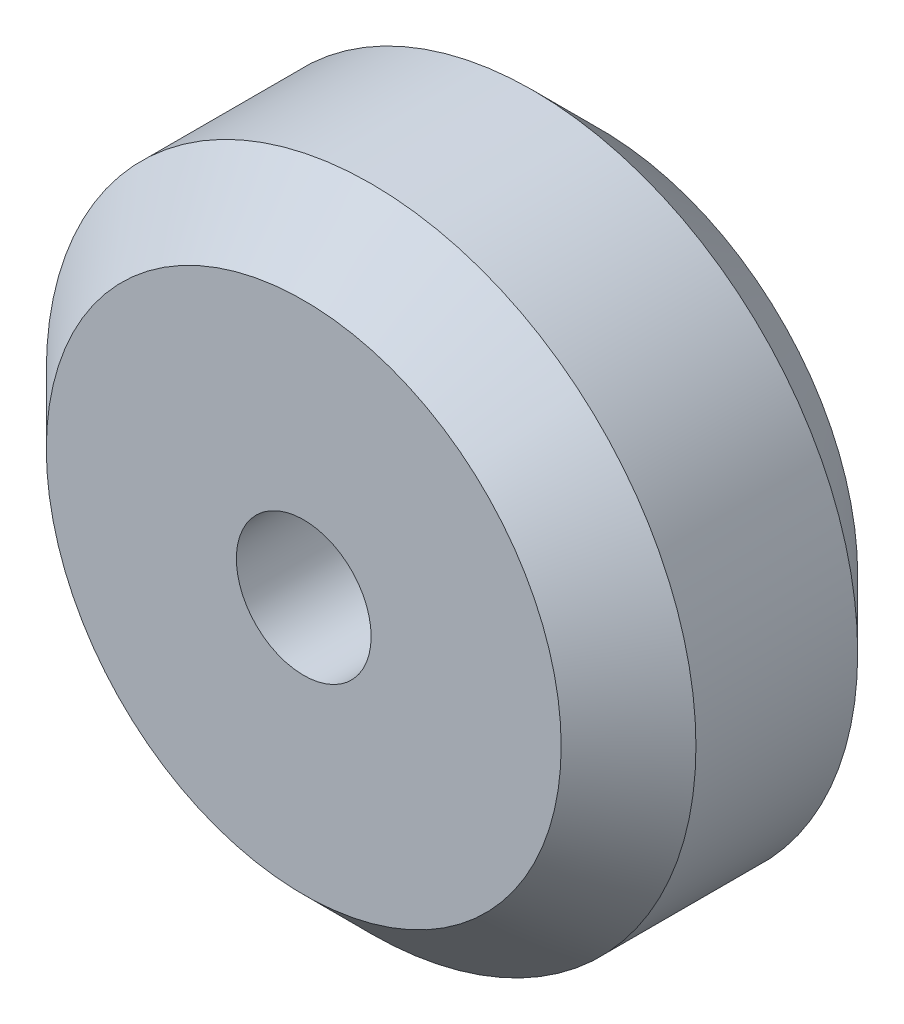
ISO-10303-21;
HEADER;
FILE_DESCRIPTION(('STEP AP214'),'2;1');
FILE_NAME('part.step','',(''),(''),'','','');
FILE_SCHEMA(('AUTOMOTIVE_DESIGN { 1 0 10303 214 1 1 1 1 }'));
ENDSEC;
DATA;
#1=APPLICATION_CONTEXT('core data for automotive mechanical design processes');
#2=APPLICATION_PROTOCOL_DEFINITION('international standard','automotive_design',2000,#1);
#3=PRODUCT_CONTEXT('',#1,'mechanical');
#4=PRODUCT('Part','Part','',(#3));
#5=PRODUCT_RELATED_PRODUCT_CATEGORY('part','',(#4));
#6=PRODUCT_DEFINITION_FORMATION('','',#4);
#7=PRODUCT_DEFINITION_CONTEXT('part definition',#1,'design');
#8=PRODUCT_DEFINITION('design','',#6,#7);
#9=PRODUCT_DEFINITION_SHAPE('','',#8);
#10=(LENGTH_UNIT() NAMED_UNIT(*) SI_UNIT(.MILLI.,.METRE.));
#11=(NAMED_UNIT(*) PLANE_ANGLE_UNIT() SI_UNIT($,.RADIAN.));
#12=(NAMED_UNIT(*) SI_UNIT($,.STERADIAN.) SOLID_ANGLE_UNIT());
#13=UNCERTAINTY_MEASURE_WITH_UNIT(LENGTH_MEASURE(1.E-05),#10,'distance_accuracy_value','');
#14=(GEOMETRIC_REPRESENTATION_CONTEXT(3) GLOBAL_UNCERTAINTY_ASSIGNED_CONTEXT((#13)) GLOBAL_UNIT_ASSIGNED_CONTEXT((#10,
#11,#12)) REPRESENTATION_CONTEXT('',''));
#15=CARTESIAN_POINT('',(0.,0.,0.));
#16=DIRECTION('',(0.,0.,1.));
#17=DIRECTION('',(1.,0.,0.));
#18=AXIS2_PLACEMENT_3D('',#15,#16,#17);
#19=CARTESIAN_POINT('',(0.,0.,11.));
#20=DIRECTION('',(0.,0.,1.));
#21=DIRECTION('',(1.,0.,0.));
#22=AXIS2_PLACEMENT_3D('',#19,#20,#21);
#23=PLANE('',#22);
#24=CARTESIAN_POINT('',(0.,0.,11.));
#25=DIRECTION('',(0.,0.,1.));
#26=DIRECTION('',(1.,0.,0.));
#27=AXIS2_PLACEMENT_3D('',#24,#25,#26);
#28=CIRCLE('',#27,9.55);
#29=CARTESIAN_POINT('',(9.55,0.,11.));
#30=VERTEX_POINT('',#29);
#31=EDGE_CURVE('E10',#30,#30,#28,.T.);
#32=ORIENTED_EDGE('',*,*,#31,.T.);
#33=EDGE_LOOP('',(#32));
#34=FACE_BOUND('',#33,.T.);
#35=CARTESIAN_POINT('',(0.,0.,11.));
#36=DIRECTION('',(0.,0.,1.));
#37=DIRECTION('',(1.,0.,0.));
#38=AXIS2_PLACEMENT_3D('',#35,#36,#37);
#39=CIRCLE('',#38,2.5);
#40=CARTESIAN_POINT('',(2.5,0.,11.));
#41=VERTEX_POINT('',#40);
#42=EDGE_CURVE('E54',#41,#41,#39,.T.);
#43=ORIENTED_EDGE('',*,*,#42,.F.);
#44=EDGE_LOOP('',(#43));
#45=FACE_BOUND('',#44,.T.);
#46=ADVANCED_FACE('F33',(#34,#45),#23,.T.);
#47=CARTESIAN_POINT('',(0.,0.,0.));
#48=DIRECTION('',(0.,0.,1.));
#49=DIRECTION('',(1.,0.,0.));
#50=AXIS2_PLACEMENT_3D('',#47,#48,#49);
#51=PLANE('',#50);
#52=CARTESIAN_POINT('',(0.,0.,0.));
#53=DIRECTION('',(0.,0.,1.));
#54=DIRECTION('',(1.,0.,0.));
#55=AXIS2_PLACEMENT_3D('',#52,#53,#54);
#56=CIRCLE('',#55,9.54999999999998);
#57=CARTESIAN_POINT('',(9.54999999999998,0.,0.));
#58=VERTEX_POINT('',#57);
#59=EDGE_CURVE('E41',#58,#58,#56,.F.);
#60=ORIENTED_EDGE('',*,*,#59,.T.);
#61=EDGE_LOOP('',(#60));
#62=FACE_BOUND('',#61,.T.);
#63=CARTESIAN_POINT('',(0.,0.,0.));
#64=DIRECTION('',(0.,0.,1.));
#65=DIRECTION('',(1.,0.,0.));
#66=AXIS2_PLACEMENT_3D('',#63,#64,#65);
#67=CIRCLE('',#66,2.5);
#68=CARTESIAN_POINT('',(2.5,0.,0.));
#69=VERTEX_POINT('',#68);
#70=EDGE_CURVE('E55',#69,#69,#67,.T.);
#71=ORIENTED_EDGE('',*,*,#70,.T.);
#72=EDGE_LOOP('',(#71));
#73=FACE_BOUND('',#72,.T.);
#74=ADVANCED_FACE('F65',(#62,#73),#51,.F.);
#75=CARTESIAN_POINT('',(0.,0.,11.));
#76=DIRECTION('',(0.,0.,-1.));
#77=DIRECTION('',(-1.,0.,0.));
#78=AXIS2_PLACEMENT_3D('',#75,#76,#77);
#79=CYLINDRICAL_SURFACE('',#78,12.05);
#80=CARTESIAN_POINT('',(0.,0.,2.50000000000001));
#81=DIRECTION('',(0.,0.,1.));
#82=DIRECTION('',(1.,0.,0.));
#83=AXIS2_PLACEMENT_3D('',#80,#81,#82);
#84=CIRCLE('',#83,12.05);
#85=CARTESIAN_POINT('',(12.05,0.,2.50000000000001));
#86=VERTEX_POINT('',#85);
#87=EDGE_CURVE('E45',#86,#86,#84,.T.);
#88=ORIENTED_EDGE('',*,*,#87,.T.);
#89=EDGE_LOOP('',(#88));
#90=FACE_BOUND('',#89,.T.);
#91=CARTESIAN_POINT('',(0.,0.,8.49999999999999));
#92=DIRECTION('',(0.,0.,1.));
#93=DIRECTION('',(1.,0.,0.));
#94=AXIS2_PLACEMENT_3D('',#91,#92,#93);
#95=CIRCLE('',#94,12.05);
#96=CARTESIAN_POINT('',(12.05,0.,8.49999999999999));
#97=VERTEX_POINT('',#96);
#98=EDGE_CURVE('E49',#97,#97,#95,.F.);
#99=ORIENTED_EDGE('',*,*,#98,.T.);
#100=EDGE_LOOP('',(#99));
#101=FACE_BOUND('',#100,.T.);
#102=ADVANCED_FACE('F71',(#90,#101),#79,.T.);
#103=CARTESIAN_POINT('',(0.,0.,11.));
#104=DIRECTION('',(0.,0.,-1.));
#105=DIRECTION('',(-1.,0.,0.));
#106=AXIS2_PLACEMENT_3D('',#103,#104,#105);
#107=CYLINDRICAL_SURFACE('',#106,2.5);
#108=ORIENTED_EDGE('',*,*,#42,.T.);
#109=EDGE_LOOP('',(#108));
#110=FACE_BOUND('',#109,.T.);
#111=ORIENTED_EDGE('',*,*,#70,.F.);
#112=EDGE_LOOP('',(#111));
#113=FACE_BOUND('',#112,.T.);
#114=ADVANCED_FACE('F61',(#110,#113),#107,.F.);
#115=CARTESIAN_POINT('',(0.,0.,2.50000000000001));
#116=DIRECTION('',(0.,0.,1.));
#117=DIRECTION('',(1.,0.,0.));
#118=AXIS2_PLACEMENT_3D('',#115,#116,#117);
#119=CONICAL_SURFACE('',#118,12.05,0.78539816339745);
#120=ORIENTED_EDGE('',*,*,#59,.F.);
#121=EDGE_LOOP('',(#120));
#122=FACE_BOUND('',#121,.T.);
#123=ORIENTED_EDGE('',*,*,#87,.F.);
#124=EDGE_LOOP('',(#123));
#125=FACE_BOUND('',#124,.T.);
#126=ADVANCED_FACE('F78',(#122,#125),#119,.T.);
#127=CARTESIAN_POINT('',(0.,0.,11.));
#128=DIRECTION('',(0.,0.,-1.));
#129=DIRECTION('',(-1.,0.,0.));
#130=AXIS2_PLACEMENT_3D('',#127,#128,#129);
#131=CONICAL_SURFACE('',#130,9.55,0.785398163397447);
#132=ORIENTED_EDGE('',*,*,#98,.F.);
#133=EDGE_LOOP('',(#132));
#134=FACE_BOUND('',#133,.T.);
#135=ORIENTED_EDGE('',*,*,#31,.F.);
#136=EDGE_LOOP('',(#135));
#137=FACE_BOUND('',#136,.T.);
#138=ADVANCED_FACE('F36',(#134,#137),#131,.T.);
#139=CLOSED_SHELL('',(#46,#74,#102,#114,#126,#138));
#140=MANIFOLD_SOLID_BREP('B2',#139);
#141=ADVANCED_BREP_SHAPE_REPRESENTATION('',(#18,#140),#14);
#142=SHAPE_DEFINITION_REPRESENTATION(#9,#141);
ENDSEC;
END-ISO-10303-21;
